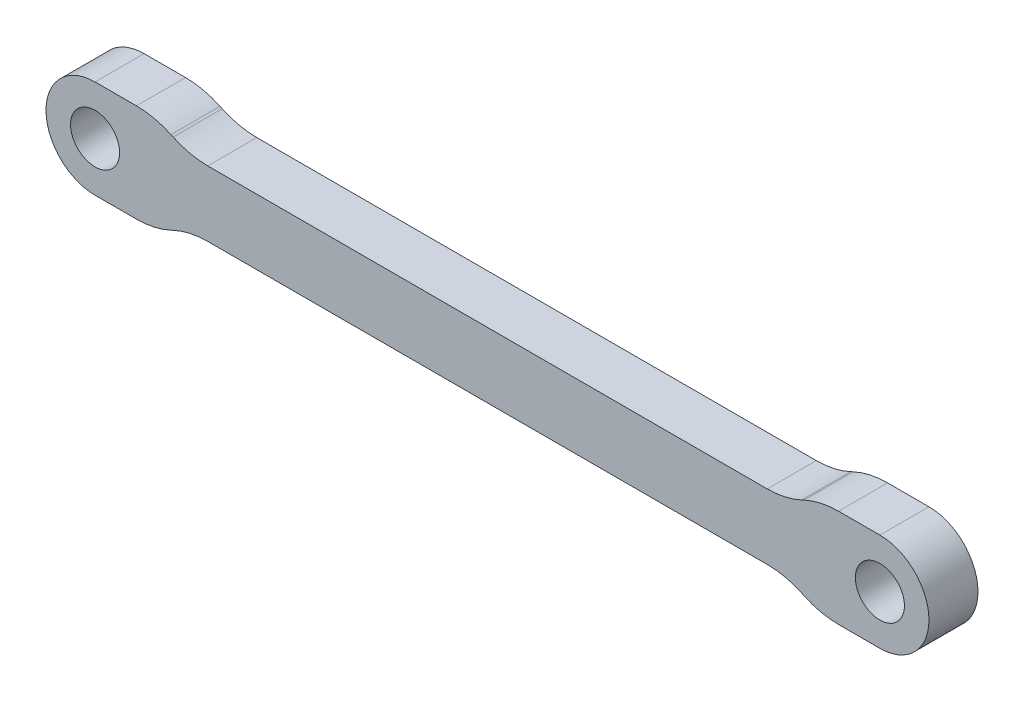
ISO-10303-21;
HEADER;
FILE_DESCRIPTION(('STEP AP214'),'2;1');
FILE_NAME('part.step','',(''),(''),'','','');
FILE_SCHEMA(('AUTOMOTIVE_DESIGN { 1 0 10303 214 1 1 1 1 }'));
ENDSEC;
DATA;
#1=APPLICATION_CONTEXT('core data for automotive mechanical design processes');
#2=APPLICATION_PROTOCOL_DEFINITION('international standard','automotive_design',2000,#1);
#3=PRODUCT_CONTEXT('',#1,'mechanical');
#4=PRODUCT('Part','Part','',(#3));
#5=PRODUCT_RELATED_PRODUCT_CATEGORY('part','',(#4));
#6=PRODUCT_DEFINITION_FORMATION('','',#4);
#7=PRODUCT_DEFINITION_CONTEXT('part definition',#1,'design');
#8=PRODUCT_DEFINITION('design','',#6,#7);
#9=PRODUCT_DEFINITION_SHAPE('','',#8);
#10=(LENGTH_UNIT() NAMED_UNIT(*) SI_UNIT(.MILLI.,.METRE.));
#11=(NAMED_UNIT(*) PLANE_ANGLE_UNIT() SI_UNIT($,.RADIAN.));
#12=(NAMED_UNIT(*) SI_UNIT($,.STERADIAN.) SOLID_ANGLE_UNIT());
#13=UNCERTAINTY_MEASURE_WITH_UNIT(LENGTH_MEASURE(1.E-05),#10,'distance_accuracy_value','');
#14=(GEOMETRIC_REPRESENTATION_CONTEXT(3) GLOBAL_UNCERTAINTY_ASSIGNED_CONTEXT((#13)) GLOBAL_UNIT_ASSIGNED_CONTEXT((#10,
#11,#12)) REPRESENTATION_CONTEXT('',''));
#15=CARTESIAN_POINT('',(0.,0.,0.));
#16=DIRECTION('',(0.,0.,1.));
#17=DIRECTION('',(1.,0.,0.));
#18=AXIS2_PLACEMENT_3D('',#15,#16,#17);
#19=CARTESIAN_POINT('',(0.,-6.,6.));
#20=DIRECTION('',(0.,1.,0.));
#21=DIRECTION('',(0.,0.,1.));
#22=AXIS2_PLACEMENT_3D('',#19,#20,#21);
#23=PLANE('',#22);
#24=DIRECTION('',(1.,0.,0.));
#25=VECTOR('',#24,1.);
#26=CARTESIAN_POINT('',(0.,-6.,6.));
#27=LINE('',#26,#25);
#28=CARTESIAN_POINT('',(90.9394812289775,-6.,6.));
#29=VERTEX_POINT('',#28);
#30=CARTESIAN_POINT('',(96.,-6.,6.));
#31=VERTEX_POINT('',#30);
#32=EDGE_CURVE('E185',#29,#31,#27,.T.);
#33=ORIENTED_EDGE('',*,*,#32,.F.);
#34=DIRECTION('',(0.,0.,1.));
#35=VECTOR('',#34,1.);
#36=CARTESIAN_POINT('',(90.9394812289775,-6.,0.));
#37=LINE('',#36,#35);
#38=CARTESIAN_POINT('',(90.9394812289775,-6.,0.));
#39=VERTEX_POINT('',#38);
#40=EDGE_CURVE('E261',#29,#39,#37,.F.);
#41=ORIENTED_EDGE('',*,*,#40,.T.);
#42=DIRECTION('',(1.,0.,0.));
#43=VECTOR('',#42,1.);
#44=CARTESIAN_POINT('',(0.,-6.,0.));
#45=LINE('',#44,#43);
#46=CARTESIAN_POINT('',(96.,-6.,0.));
#47=VERTEX_POINT('',#46);
#48=EDGE_CURVE('E338',#39,#47,#45,.T.);
#49=ORIENTED_EDGE('',*,*,#48,.T.);
#50=DIRECTION('',(0.,0.,-1.));
#51=VECTOR('',#50,1.);
#52=CARTESIAN_POINT('',(96.,-6.,6.));
#53=LINE('',#52,#51);
#54=EDGE_CURVE('E202',#31,#47,#53,.T.);
#55=ORIENTED_EDGE('',*,*,#54,.F.);
#56=EDGE_LOOP('',(#33,#41,#49,#55));
#57=FACE_BOUND('',#56,.T.);
#58=ADVANCED_FACE('F36',(#57),#23,.F.);
#59=CARTESIAN_POINT('',(0.,6.,6.));
#60=DIRECTION('',(0.,-1.,0.));
#61=DIRECTION('',(0.,0.,-1.));
#62=AXIS2_PLACEMENT_3D('',#59,#60,#61);
#63=PLANE('',#62);
#64=DIRECTION('',(-1.,0.,0.));
#65=VECTOR('',#64,1.);
#66=CARTESIAN_POINT('',(0.,6.,6.));
#67=LINE('',#66,#65);
#68=CARTESIAN_POINT('',(5.06051877102256,6.,6.));
#69=VERTEX_POINT('',#68);
#70=CARTESIAN_POINT('',(0.,6.,6.));
#71=VERTEX_POINT('',#70);
#72=EDGE_CURVE('E192',#69,#71,#67,.T.);
#73=ORIENTED_EDGE('',*,*,#72,.F.);
#74=DIRECTION('',(0.,0.,1.));
#75=VECTOR('',#74,1.);
#76=CARTESIAN_POINT('',(5.06051877102256,6.,0.));
#77=LINE('',#76,#75);
#78=CARTESIAN_POINT('',(5.06051877102256,6.,0.));
#79=VERTEX_POINT('',#78);
#80=EDGE_CURVE('E280',#69,#79,#77,.F.);
#81=ORIENTED_EDGE('',*,*,#80,.T.);
#82=DIRECTION('',(-1.,0.,0.));
#83=VECTOR('',#82,1.);
#84=CARTESIAN_POINT('',(0.,6.,0.));
#85=LINE('',#84,#83);
#86=CARTESIAN_POINT('',(0.,6.,0.));
#87=VERTEX_POINT('',#86);
#88=EDGE_CURVE('E343',#79,#87,#85,.T.);
#89=ORIENTED_EDGE('',*,*,#88,.T.);
#90=DIRECTION('',(0.,0.,-1.));
#91=VECTOR('',#90,1.);
#92=CARTESIAN_POINT('',(0.,6.,6.));
#93=LINE('',#92,#91);
#94=EDGE_CURVE('E336',#71,#87,#93,.T.);
#95=ORIENTED_EDGE('',*,*,#94,.F.);
#96=EDGE_LOOP('',(#73,#81,#89,#95));
#97=FACE_BOUND('',#96,.T.);
#98=ADVANCED_FACE('F400',(#97),#63,.F.);
#99=CARTESIAN_POINT('',(0.,0.,6.));
#100=DIRECTION('',(0.,0.,1.));
#101=DIRECTION('',(1.,0.,0.));
#102=AXIS2_PLACEMENT_3D('',#99,#100,#101);
#103=PLANE('',#102);
#104=CARTESIAN_POINT('',(0.,-6.,6.));
#105=VERTEX_POINT('',#104);
#106=CARTESIAN_POINT('',(5.06051877102256,-6.,6.));
#107=VERTEX_POINT('',#106);
#108=EDGE_CURVE('E174',#105,#107,#27,.T.);
#109=ORIENTED_EDGE('',*,*,#108,.T.);
#110=CARTESIAN_POINT('',(5.06051877102256,4.,6.));
#111=DIRECTION('',(0.,0.,1.));
#112=DIRECTION('',(1.,0.,0.));
#113=AXIS2_PLACEMENT_3D('',#110,#111,#112);
#114=CIRCLE('',#113,10.);
#115=CARTESIAN_POINT('',(9.28670138842951,-5.06307787036652,6.));
#116=VERTEX_POINT('',#115);
#117=EDGE_CURVE('E248',#107,#116,#114,.T.);
#118=ORIENTED_EDGE('',*,*,#117,.T.);
#119=DIRECTION('',(-0.906307787036652,-0.422618261740695,0.));
#120=VECTOR('',#119,1.);
#121=CARTESIAN_POINT('',(3.59793373438054,-7.71579379291397,6.));
#122=LINE('',#121,#120);
#123=CARTESIAN_POINT('',(9.55724324749352,-4.93692212963348,6.));
#124=VERTEX_POINT('',#123);
#125=EDGE_CURVE('E205',#116,#124,#122,.F.);
#126=ORIENTED_EDGE('',*,*,#125,.T.);
#127=CARTESIAN_POINT('',(13.7834258649005,-14.,6.));
#128=DIRECTION('',(0.,0.,1.));
#129=DIRECTION('',(1.,0.,0.));
#130=AXIS2_PLACEMENT_3D('',#127,#128,#129);
#131=CIRCLE('',#130,10.);
#132=CARTESIAN_POINT('',(13.7834258649005,-4.,6.));
#133=VERTEX_POINT('',#132);
#134=EDGE_CURVE('E285',#124,#133,#131,.F.);
#135=ORIENTED_EDGE('',*,*,#134,.T.);
#136=DIRECTION('',(-1.,0.,0.));
#137=VECTOR('',#136,1.);
#138=CARTESIAN_POINT('',(18.,-4.,6.));
#139=LINE('',#138,#137);
#140=CARTESIAN_POINT('',(82.2165741350996,-4.,6.));
#141=VERTEX_POINT('',#140);
#142=EDGE_CURVE('E312',#141,#133,#139,.T.);
#143=ORIENTED_EDGE('',*,*,#142,.F.);
#144=CARTESIAN_POINT('',(82.2165741350996,-14.,6.));
#145=DIRECTION('',(0.,0.,1.));
#146=DIRECTION('',(1.,0.,0.));
#147=AXIS2_PLACEMENT_3D('',#144,#145,#146);
#148=CIRCLE('',#147,10.);
#149=CARTESIAN_POINT('',(86.4427567525065,-4.93692212963347,6.));
#150=VERTEX_POINT('',#149);
#151=EDGE_CURVE('E287',#141,#150,#148,.F.);
#152=ORIENTED_EDGE('',*,*,#151,.T.);
#153=DIRECTION('',(-0.906307787036653,0.422618261740693,0.));
#154=VECTOR('',#153,1.);
#155=CARTESIAN_POINT('',(13.5482610006651,29.0543394767966,6.));
#156=LINE('',#155,#154);
#157=CARTESIAN_POINT('',(86.7132986115706,-5.06307787036654,6.));
#158=VERTEX_POINT('',#157);
#159=EDGE_CURVE('E214',#150,#158,#156,.F.);
#160=ORIENTED_EDGE('',*,*,#159,.T.);
#161=CARTESIAN_POINT('',(90.9394812289775,4.,6.));
#162=DIRECTION('',(0.,0.,1.));
#163=DIRECTION('',(1.,0.,0.));
#164=AXIS2_PLACEMENT_3D('',#161,#162,#163);
#165=CIRCLE('',#164,10.);
#166=EDGE_CURVE('E246',#158,#29,#165,.T.);
#167=ORIENTED_EDGE('',*,*,#166,.T.);
#168=ORIENTED_EDGE('',*,*,#32,.T.);
#169=CARTESIAN_POINT('',(96.,0.,6.));
#170=DIRECTION('',(0.,0.,1.));
#171=DIRECTION('',(1.,0.,0.));
#172=AXIS2_PLACEMENT_3D('',#169,#170,#171);
#173=CIRCLE('',#172,6.);
#174=CARTESIAN_POINT('',(96.,6.,6.));
#175=VERTEX_POINT('',#174);
#176=EDGE_CURVE('E184',#31,#175,#173,.T.);
#177=ORIENTED_EDGE('',*,*,#176,.T.);
#178=CARTESIAN_POINT('',(90.9394812289774,6.,6.));
#179=VERTEX_POINT('',#178);
#180=EDGE_CURVE('E333',#175,#179,#67,.T.);
#181=ORIENTED_EDGE('',*,*,#180,.T.);
#182=CARTESIAN_POINT('',(90.9394812289774,-4.,6.));
#183=DIRECTION('',(0.,0.,1.));
#184=DIRECTION('',(1.,0.,0.));
#185=AXIS2_PLACEMENT_3D('',#182,#183,#184);
#186=CIRCLE('',#185,10.);
#187=CARTESIAN_POINT('',(86.7132986115705,5.06307787036651,6.));
#188=VERTEX_POINT('',#187);
#189=EDGE_CURVE('E244',#179,#188,#186,.T.);
#190=ORIENTED_EDGE('',*,*,#189,.T.);
#191=DIRECTION('',(0.906307787036652,0.422618261740696,0.));
#192=VECTOR('',#191,1.);
#193=CARTESIAN_POINT('',(13.5482610006653,-29.0543394767967,6.));
#194=LINE('',#193,#192);
#195=CARTESIAN_POINT('',(86.4427567525065,4.9369221296335,6.));
#196=VERTEX_POINT('',#195);
#197=EDGE_CURVE('E217',#188,#196,#194,.F.);
#198=ORIENTED_EDGE('',*,*,#197,.T.);
#199=CARTESIAN_POINT('',(82.2165741350995,14.,6.));
#200=DIRECTION('',(0.,0.,1.));
#201=DIRECTION('',(1.,0.,0.));
#202=AXIS2_PLACEMENT_3D('',#199,#200,#201);
#203=CIRCLE('',#202,10.);
#204=CARTESIAN_POINT('',(82.2165741350995,4.,6.));
#205=VERTEX_POINT('',#204);
#206=EDGE_CURVE('E293',#196,#205,#203,.F.);
#207=ORIENTED_EDGE('',*,*,#206,.T.);
#208=DIRECTION('',(1.,0.,0.));
#209=VECTOR('',#208,1.);
#210=CARTESIAN_POINT('',(78.,4.,6.));
#211=LINE('',#210,#209);
#212=CARTESIAN_POINT('',(13.7834258649005,4.,6.));
#213=VERTEX_POINT('',#212);
#214=EDGE_CURVE('E297',#213,#205,#211,.T.);
#215=ORIENTED_EDGE('',*,*,#214,.F.);
#216=CARTESIAN_POINT('',(13.7834258649005,14.,6.));
#217=DIRECTION('',(0.,0.,1.));
#218=DIRECTION('',(1.,0.,0.));
#219=AXIS2_PLACEMENT_3D('',#216,#217,#218);
#220=CIRCLE('',#219,10.);
#221=CARTESIAN_POINT('',(9.55724324749353,4.93692212963348,6.));
#222=VERTEX_POINT('',#221);
#223=EDGE_CURVE('E44',#213,#222,#220,.F.);
#224=ORIENTED_EDGE('',*,*,#223,.T.);
#225=DIRECTION('',(0.906307787036652,-0.422618261740695,0.));
#226=VECTOR('',#225,1.);
#227=CARTESIAN_POINT('',(3.59793373438054,7.71579379291397,6.));
#228=LINE('',#227,#226);
#229=CARTESIAN_POINT('',(9.28670138842951,5.06307787036652,6.));
#230=VERTEX_POINT('',#229);
#231=EDGE_CURVE('E201',#222,#230,#228,.F.);
#232=ORIENTED_EDGE('',*,*,#231,.T.);
#233=CARTESIAN_POINT('',(5.06051877102256,-4.,6.));
#234=DIRECTION('',(0.,0.,1.));
#235=DIRECTION('',(1.,0.,0.));
#236=AXIS2_PLACEMENT_3D('',#233,#234,#235);
#237=CIRCLE('',#236,10.);
#238=EDGE_CURVE('E242',#230,#69,#237,.T.);
#239=ORIENTED_EDGE('',*,*,#238,.T.);
#240=ORIENTED_EDGE('',*,*,#72,.T.);
#241=CARTESIAN_POINT('',(0.,0.,6.));
#242=DIRECTION('',(0.,0.,1.));
#243=DIRECTION('',(1.,0.,0.));
#244=AXIS2_PLACEMENT_3D('',#241,#242,#243);
#245=CIRCLE('',#244,6.);
#246=EDGE_CURVE('E188',#71,#105,#245,.T.);
#247=ORIENTED_EDGE('',*,*,#246,.T.);
#248=EDGE_LOOP('',(#109,#118,#126,#135,#143,#152,#160,#167,#168,#177,#181,#190,#198,#207,#215,
#224,#232,#239,#240,#247));
#249=FACE_BOUND('',#248,.T.);
#250=CARTESIAN_POINT('',(0.,0.,6.));
#251=DIRECTION('',(0.,0.,1.));
#252=DIRECTION('',(1.,0.,0.));
#253=AXIS2_PLACEMENT_3D('',#250,#251,#252);
#254=CIRCLE('',#253,3.);
#255=CARTESIAN_POINT('',(3.,0.,6.));
#256=VERTEX_POINT('',#255);
#257=EDGE_CURVE('E327',#256,#256,#254,.T.);
#258=ORIENTED_EDGE('',*,*,#257,.F.);
#259=EDGE_LOOP('',(#258));
#260=FACE_BOUND('',#259,.T.);
#261=CARTESIAN_POINT('',(96.,0.,6.));
#262=DIRECTION('',(0.,0.,1.));
#263=DIRECTION('',(1.,0.,0.));
#264=AXIS2_PLACEMENT_3D('',#261,#262,#263);
#265=CIRCLE('',#264,3.00000000000001);
#266=CARTESIAN_POINT('',(99.,0.,6.));
#267=VERTEX_POINT('',#266);
#268=EDGE_CURVE('E320',#267,#267,#265,.T.);
#269=ORIENTED_EDGE('',*,*,#268,.F.);
#270=EDGE_LOOP('',(#269));
#271=FACE_BOUND('',#270,.T.);
#272=ADVANCED_FACE('F189',(#249,#260,#271),#103,.T.);
#273=CARTESIAN_POINT('',(0.,0.,0.));
#274=DIRECTION('',(0.,0.,1.));
#275=DIRECTION('',(1.,0.,0.));
#276=AXIS2_PLACEMENT_3D('',#273,#274,#275);
#277=PLANE('',#276);
#278=DIRECTION('',(0.906307787036652,0.422618261740695,0.));
#279=VECTOR('',#278,1.);
#280=CARTESIAN_POINT('',(7.27746539745193,-6.,0.));
#281=LINE('',#280,#279);
#282=CARTESIAN_POINT('',(9.55724324749352,-4.93692212963348,0.));
#283=VERTEX_POINT('',#282);
#284=CARTESIAN_POINT('',(9.28670138842951,-5.06307787036652,0.));
#285=VERTEX_POINT('',#284);
#286=EDGE_CURVE('E222',#283,#285,#281,.F.);
#287=ORIENTED_EDGE('',*,*,#286,.T.);
#288=CARTESIAN_POINT('',(5.06051877102256,4.,0.));
#289=DIRECTION('',(0.,0.,1.));
#290=DIRECTION('',(1.,0.,0.));
#291=AXIS2_PLACEMENT_3D('',#288,#289,#290);
#292=CIRCLE('',#291,10.);
#293=CARTESIAN_POINT('',(5.06051877102256,-6.,0.));
#294=VERTEX_POINT('',#293);
#295=EDGE_CURVE('E255',#285,#294,#292,.F.);
#296=ORIENTED_EDGE('',*,*,#295,.T.);
#297=CARTESIAN_POINT('',(0.,-6.,0.));
#298=VERTEX_POINT('',#297);
#299=EDGE_CURVE('E339',#298,#294,#45,.T.);
#300=ORIENTED_EDGE('',*,*,#299,.F.);
#301=CARTESIAN_POINT('',(0.,0.,0.));
#302=DIRECTION('',(0.,0.,1.));
#303=DIRECTION('',(1.,0.,0.));
#304=AXIS2_PLACEMENT_3D('',#301,#302,#303);
#305=CIRCLE('',#304,6.);
#306=EDGE_CURVE('E200',#87,#298,#305,.T.);
#307=ORIENTED_EDGE('',*,*,#306,.F.);
#308=ORIENTED_EDGE('',*,*,#88,.F.);
#309=CARTESIAN_POINT('',(5.06051877102256,-4.,0.));
#310=DIRECTION('',(0.,0.,1.));
#311=DIRECTION('',(1.,0.,0.));
#312=AXIS2_PLACEMENT_3D('',#309,#310,#311);
#313=CIRCLE('',#312,10.);
#314=CARTESIAN_POINT('',(9.28670138842951,5.06307787036652,0.));
#315=VERTEX_POINT('',#314);
#316=EDGE_CURVE('E58',#79,#315,#313,.F.);
#317=ORIENTED_EDGE('',*,*,#316,.T.);
#318=DIRECTION('',(-0.906307787036652,0.422618261740695,0.));
#319=VECTOR('',#318,1.);
#320=CARTESIAN_POINT('',(7.27746539745193,6.,0.));
#321=LINE('',#320,#319);
#322=CARTESIAN_POINT('',(9.55724324749353,4.93692212963348,0.));
#323=VERTEX_POINT('',#322);
#324=EDGE_CURVE('E220',#315,#323,#321,.F.);
#325=ORIENTED_EDGE('',*,*,#324,.T.);
#326=CARTESIAN_POINT('',(13.7834258649005,14.,0.));
#327=DIRECTION('',(0.,0.,1.));
#328=DIRECTION('',(1.,0.,0.));
#329=AXIS2_PLACEMENT_3D('',#326,#327,#328);
#330=CIRCLE('',#329,10.);
#331=CARTESIAN_POINT('',(13.7834258649005,4.,0.));
#332=VERTEX_POINT('',#331);
#333=EDGE_CURVE('E11',#323,#332,#330,.T.);
#334=ORIENTED_EDGE('',*,*,#333,.T.);
#335=DIRECTION('',(1.,0.,0.));
#336=VECTOR('',#335,1.);
#337=CARTESIAN_POINT('',(78.,4.,0.));
#338=LINE('',#337,#336);
#339=CARTESIAN_POINT('',(82.2165741350995,4.,0.));
#340=VERTEX_POINT('',#339);
#341=EDGE_CURVE('E308',#332,#340,#338,.T.);
#342=ORIENTED_EDGE('',*,*,#341,.T.);
#343=CARTESIAN_POINT('',(82.2165741350995,14.,0.));
#344=DIRECTION('',(0.,0.,1.));
#345=DIRECTION('',(1.,0.,0.));
#346=AXIS2_PLACEMENT_3D('',#343,#344,#345);
#347=CIRCLE('',#346,10.);
#348=CARTESIAN_POINT('',(86.4427567525065,4.93692212963349,0.));
#349=VERTEX_POINT('',#348);
#350=EDGE_CURVE('E291',#340,#349,#347,.T.);
#351=ORIENTED_EDGE('',*,*,#350,.T.);
#352=DIRECTION('',(-0.906307787036652,-0.422618261740696,0.));
#353=VECTOR('',#352,1.);
#354=CARTESIAN_POINT('',(88.7225346025481,6.,0.));
#355=LINE('',#354,#353);
#356=CARTESIAN_POINT('',(86.7132986115705,5.06307787036651,0.));
#357=VERTEX_POINT('',#356);
#358=EDGE_CURVE('E228',#349,#357,#355,.F.);
#359=ORIENTED_EDGE('',*,*,#358,.T.);
#360=CARTESIAN_POINT('',(90.9394812289774,-4.,0.));
#361=DIRECTION('',(0.,0.,1.));
#362=DIRECTION('',(1.,0.,0.));
#363=AXIS2_PLACEMENT_3D('',#360,#361,#362);
#364=CIRCLE('',#363,10.);
#365=CARTESIAN_POINT('',(90.9394812289774,6.,0.));
#366=VERTEX_POINT('',#365);
#367=EDGE_CURVE('E251',#357,#366,#364,.F.);
#368=ORIENTED_EDGE('',*,*,#367,.T.);
#369=CARTESIAN_POINT('',(96.,6.,0.));
#370=VERTEX_POINT('',#369);
#371=EDGE_CURVE('E196',#370,#366,#85,.T.);
#372=ORIENTED_EDGE('',*,*,#371,.F.);
#373=CARTESIAN_POINT('',(96.,0.,0.));
#374=DIRECTION('',(0.,0.,1.));
#375=DIRECTION('',(1.,0.,0.));
#376=AXIS2_PLACEMENT_3D('',#373,#374,#375);
#377=CIRCLE('',#376,6.);
#378=EDGE_CURVE('E341',#47,#370,#377,.T.);
#379=ORIENTED_EDGE('',*,*,#378,.F.);
#380=ORIENTED_EDGE('',*,*,#48,.F.);
#381=CARTESIAN_POINT('',(90.9394812289775,4.,0.));
#382=DIRECTION('',(0.,0.,1.));
#383=DIRECTION('',(1.,0.,0.));
#384=AXIS2_PLACEMENT_3D('',#381,#382,#383);
#385=CIRCLE('',#384,10.);
#386=CARTESIAN_POINT('',(86.7132986115706,-5.06307787036653,0.));
#387=VERTEX_POINT('',#386);
#388=EDGE_CURVE('E253',#39,#387,#385,.F.);
#389=ORIENTED_EDGE('',*,*,#388,.T.);
#390=DIRECTION('',(0.906307787036653,-0.422618261740693,0.));
#391=VECTOR('',#390,1.);
#392=CARTESIAN_POINT('',(88.7225346025481,-6.,0.));
#393=LINE('',#392,#391);
#394=CARTESIAN_POINT('',(86.4427567525065,-4.93692212963347,0.));
#395=VERTEX_POINT('',#394);
#396=EDGE_CURVE('E225',#387,#395,#393,.F.);
#397=ORIENTED_EDGE('',*,*,#396,.T.);
#398=CARTESIAN_POINT('',(82.2165741350996,-14.,0.));
#399=DIRECTION('',(0.,0.,1.));
#400=DIRECTION('',(1.,0.,0.));
#401=AXIS2_PLACEMENT_3D('',#398,#399,#400);
#402=CIRCLE('',#401,10.);
#403=CARTESIAN_POINT('',(82.2165741350996,-4.,0.));
#404=VERTEX_POINT('',#403);
#405=EDGE_CURVE('E289',#395,#404,#402,.T.);
#406=ORIENTED_EDGE('',*,*,#405,.T.);
#407=DIRECTION('',(-1.,0.,0.));
#408=VECTOR('',#407,1.);
#409=CARTESIAN_POINT('',(18.,-4.,0.));
#410=LINE('',#409,#408);
#411=CARTESIAN_POINT('',(13.7834258649005,-4.,0.));
#412=VERTEX_POINT('',#411);
#413=EDGE_CURVE('E315',#404,#412,#410,.T.);
#414=ORIENTED_EDGE('',*,*,#413,.T.);
#415=CARTESIAN_POINT('',(13.7834258649005,-14.,0.));
#416=DIRECTION('',(0.,0.,1.));
#417=DIRECTION('',(1.,0.,0.));
#418=AXIS2_PLACEMENT_3D('',#415,#416,#417);
#419=CIRCLE('',#418,10.);
#420=EDGE_CURVE('E283',#412,#283,#419,.T.);
#421=ORIENTED_EDGE('',*,*,#420,.T.);
#422=EDGE_LOOP('',(#287,#296,#300,#307,#308,#317,#325,#334,#342,#351,#359,#368,#372,#379,#380,
#389,#397,#406,#414,#421));
#423=FACE_BOUND('',#422,.T.);
#424=CARTESIAN_POINT('',(0.,0.,0.));
#425=DIRECTION('',(0.,0.,1.));
#426=DIRECTION('',(1.,0.,0.));
#427=AXIS2_PLACEMENT_3D('',#424,#425,#426);
#428=CIRCLE('',#427,3.);
#429=CARTESIAN_POINT('',(3.,0.,0.));
#430=VERTEX_POINT('',#429);
#431=EDGE_CURVE('E323',#430,#430,#428,.T.);
#432=ORIENTED_EDGE('',*,*,#431,.T.);
#433=EDGE_LOOP('',(#432));
#434=FACE_BOUND('',#433,.T.);
#435=CARTESIAN_POINT('',(96.,0.,0.));
#436=DIRECTION('',(0.,0.,1.));
#437=DIRECTION('',(1.,0.,0.));
#438=AXIS2_PLACEMENT_3D('',#435,#436,#437);
#439=CIRCLE('',#438,3.00000000000001);
#440=CARTESIAN_POINT('',(99.,0.,0.));
#441=VERTEX_POINT('',#440);
#442=EDGE_CURVE('E324',#441,#441,#439,.T.);
#443=ORIENTED_EDGE('',*,*,#442,.T.);
#444=EDGE_LOOP('',(#443));
#445=FACE_BOUND('',#444,.T.);
#446=ADVANCED_FACE('F306',(#423,#434,#445),#277,.F.);
#447=CARTESIAN_POINT('',(0.,0.,6.));
#448=DIRECTION('',(0.,0.,-1.));
#449=DIRECTION('',(-1.,0.,0.));
#450=AXIS2_PLACEMENT_3D('',#447,#448,#449);
#451=CYLINDRICAL_SURFACE('',#450,6.);
#452=ORIENTED_EDGE('',*,*,#306,.T.);
#453=DIRECTION('',(0.,0.,-1.));
#454=VECTOR('',#453,1.);
#455=CARTESIAN_POINT('',(0.,-6.,6.));
#456=LINE('',#455,#454);
#457=EDGE_CURVE('E179',#105,#298,#456,.T.);
#458=ORIENTED_EDGE('',*,*,#457,.F.);
#459=ORIENTED_EDGE('',*,*,#246,.F.);
#460=ORIENTED_EDGE('',*,*,#94,.T.);
#461=EDGE_LOOP('',(#452,#458,#459,#460));
#462=FACE_BOUND('',#461,.T.);
#463=ADVANCED_FACE('F198',(#462),#451,.T.);
#464=ORIENTED_EDGE('',*,*,#299,.T.);
#465=DIRECTION('',(0.,0.,-1.));
#466=VECTOR('',#465,1.);
#467=CARTESIAN_POINT('',(5.06051877102256,-6.,6.));
#468=LINE('',#467,#466);
#469=EDGE_CURVE('E182',#294,#107,#468,.F.);
#470=ORIENTED_EDGE('',*,*,#469,.T.);
#471=ORIENTED_EDGE('',*,*,#108,.F.);
#472=ORIENTED_EDGE('',*,*,#457,.T.);
#473=EDGE_LOOP('',(#464,#470,#471,#472));
#474=FACE_BOUND('',#473,.T.);
#475=ADVANCED_FACE('F177',(#474),#23,.F.);
#476=CARTESIAN_POINT('',(96.,0.,6.));
#477=DIRECTION('',(0.,0.,-1.));
#478=DIRECTION('',(-1.,0.,0.));
#479=AXIS2_PLACEMENT_3D('',#476,#477,#478);
#480=CYLINDRICAL_SURFACE('',#479,6.);
#481=ORIENTED_EDGE('',*,*,#378,.T.);
#482=DIRECTION('',(0.,0.,-1.));
#483=VECTOR('',#482,1.);
#484=CARTESIAN_POINT('',(96.,6.,6.));
#485=LINE('',#484,#483);
#486=EDGE_CURVE('E208',#175,#370,#485,.T.);
#487=ORIENTED_EDGE('',*,*,#486,.F.);
#488=ORIENTED_EDGE('',*,*,#176,.F.);
#489=ORIENTED_EDGE('',*,*,#54,.T.);
#490=EDGE_LOOP('',(#481,#487,#488,#489));
#491=FACE_BOUND('',#490,.T.);
#492=ADVANCED_FACE('F365',(#491),#480,.T.);
#493=ORIENTED_EDGE('',*,*,#371,.T.);
#494=DIRECTION('',(0.,0.,-1.));
#495=VECTOR('',#494,1.);
#496=CARTESIAN_POINT('',(90.9394812289774,6.,6.));
#497=LINE('',#496,#495);
#498=EDGE_CURVE('E274',#366,#179,#497,.F.);
#499=ORIENTED_EDGE('',*,*,#498,.T.);
#500=ORIENTED_EDGE('',*,*,#180,.F.);
#501=ORIENTED_EDGE('',*,*,#486,.T.);
#502=EDGE_LOOP('',(#493,#499,#500,#501));
#503=FACE_BOUND('',#502,.T.);
#504=ADVANCED_FACE('F351',(#503),#63,.F.);
#505=CARTESIAN_POINT('',(0.,0.,6.));
#506=DIRECTION('',(0.,0.,-1.));
#507=DIRECTION('',(-1.,0.,0.));
#508=AXIS2_PLACEMENT_3D('',#505,#506,#507);
#509=CYLINDRICAL_SURFACE('',#508,3.);
#510=ORIENTED_EDGE('',*,*,#257,.T.);
#511=EDGE_LOOP('',(#510));
#512=FACE_BOUND('',#511,.T.);
#513=ORIENTED_EDGE('',*,*,#431,.F.);
#514=EDGE_LOOP('',(#513));
#515=FACE_BOUND('',#514,.T.);
#516=ADVANCED_FACE('F542',(#512,#515),#509,.F.);
#517=CARTESIAN_POINT('',(96.,0.,6.));
#518=DIRECTION('',(0.,0.,-1.));
#519=DIRECTION('',(-1.,0.,0.));
#520=AXIS2_PLACEMENT_3D('',#517,#518,#519);
#521=CYLINDRICAL_SURFACE('',#520,3.00000000000001);
#522=ORIENTED_EDGE('',*,*,#268,.T.);
#523=EDGE_LOOP('',(#522));
#524=FACE_BOUND('',#523,.T.);
#525=ORIENTED_EDGE('',*,*,#442,.F.);
#526=EDGE_LOOP('',(#525));
#527=FACE_BOUND('',#526,.T.);
#528=ADVANCED_FACE('F523',(#524,#527),#521,.F.);
#529=CARTESIAN_POINT('',(78.,4.,0.));
#530=DIRECTION('',(0.,-1.,0.));
#531=DIRECTION('',(0.,0.,-1.));
#532=AXIS2_PLACEMENT_3D('',#529,#530,#531);
#533=PLANE('',#532);
#534=ORIENTED_EDGE('',*,*,#214,.T.);
#535=DIRECTION('',(0.,0.,1.));
#536=VECTOR('',#535,1.);
#537=CARTESIAN_POINT('',(82.2165741350995,4.,0.));
#538=LINE('',#537,#536);
#539=EDGE_CURVE('E267',#205,#340,#538,.F.);
#540=ORIENTED_EDGE('',*,*,#539,.T.);
#541=ORIENTED_EDGE('',*,*,#341,.F.);
#542=DIRECTION('',(0.,0.,-1.));
#543=VECTOR('',#542,1.);
#544=CARTESIAN_POINT('',(13.7834258649005,4.,0.));
#545=LINE('',#544,#543);
#546=EDGE_CURVE('E264',#332,#213,#545,.F.);
#547=ORIENTED_EDGE('',*,*,#546,.T.);
#548=EDGE_LOOP('',(#534,#540,#541,#547));
#549=FACE_BOUND('',#548,.T.);
#550=ADVANCED_FACE('F310',(#549),#533,.F.);
#551=CARTESIAN_POINT('',(18.,-4.,0.));
#552=DIRECTION('',(0.,1.,0.));
#553=DIRECTION('',(0.,0.,1.));
#554=AXIS2_PLACEMENT_3D('',#551,#552,#553);
#555=PLANE('',#554);
#556=ORIENTED_EDGE('',*,*,#142,.T.);
#557=DIRECTION('',(0.,0.,1.));
#558=VECTOR('',#557,1.);
#559=CARTESIAN_POINT('',(13.7834258649005,-4.,0.));
#560=LINE('',#559,#558);
#561=EDGE_CURVE('E234',#133,#412,#560,.F.);
#562=ORIENTED_EDGE('',*,*,#561,.T.);
#563=ORIENTED_EDGE('',*,*,#413,.F.);
#564=DIRECTION('',(0.,0.,-1.));
#565=VECTOR('',#564,1.);
#566=CARTESIAN_POINT('',(82.2165741350996,-4.,0.));
#567=LINE('',#566,#565);
#568=EDGE_CURVE('E231',#404,#141,#567,.F.);
#569=ORIENTED_EDGE('',*,*,#568,.T.);
#570=EDGE_LOOP('',(#556,#562,#563,#569));
#571=FACE_BOUND('',#570,.T.);
#572=ADVANCED_FACE('F385',(#571),#555,.F.);
#573=CARTESIAN_POINT('',(88.7225346025481,6.,6.));
#574=DIRECTION('',(0.422618261740696,-0.906307787036652,0.));
#575=DIRECTION('',(0.,0.,1.));
#576=AXIS2_PLACEMENT_3D('',#573,#574,#575);
#577=PLANE('',#576);
#578=ORIENTED_EDGE('',*,*,#358,.F.);
#579=DIRECTION('',(0.,0.,-1.));
#580=VECTOR('',#579,1.);
#581=CARTESIAN_POINT('',(86.4427567525065,4.93692212963349,6.));
#582=LINE('',#581,#580);
#583=EDGE_CURVE('E272',#349,#196,#582,.F.);
#584=ORIENTED_EDGE('',*,*,#583,.T.);
#585=ORIENTED_EDGE('',*,*,#197,.F.);
#586=DIRECTION('',(0.,0.,1.));
#587=VECTOR('',#586,1.);
#588=CARTESIAN_POINT('',(86.7132986115705,5.06307787036651,0.));
#589=LINE('',#588,#587);
#590=EDGE_CURVE('E270',#188,#357,#589,.F.);
#591=ORIENTED_EDGE('',*,*,#590,.T.);
#592=EDGE_LOOP('',(#578,#584,#585,#591));
#593=FACE_BOUND('',#592,.T.);
#594=ADVANCED_FACE('F425',(#593),#577,.F.);
#595=CARTESIAN_POINT('',(88.7225346025481,-6.,6.));
#596=DIRECTION('',(0.422618261740693,0.906307787036653,0.));
#597=DIRECTION('',(0.,0.,-1.));
#598=AXIS2_PLACEMENT_3D('',#595,#596,#597);
#599=PLANE('',#598);
#600=ORIENTED_EDGE('',*,*,#159,.F.);
#601=DIRECTION('',(0.,0.,1.));
#602=VECTOR('',#601,1.);
#603=CARTESIAN_POINT('',(86.4427567525065,-4.93692212963347,6.));
#604=LINE('',#603,#602);
#605=EDGE_CURVE('E259',#150,#395,#604,.F.);
#606=ORIENTED_EDGE('',*,*,#605,.T.);
#607=ORIENTED_EDGE('',*,*,#396,.F.);
#608=DIRECTION('',(0.,0.,-1.));
#609=VECTOR('',#608,1.);
#610=CARTESIAN_POINT('',(86.7132986115706,-5.06307787036653,6.));
#611=LINE('',#610,#609);
#612=EDGE_CURVE('E257',#387,#158,#611,.F.);
#613=ORIENTED_EDGE('',*,*,#612,.T.);
#614=EDGE_LOOP('',(#600,#606,#607,#613));
#615=FACE_BOUND('',#614,.T.);
#616=ADVANCED_FACE('F374',(#615),#599,.F.);
#617=CARTESIAN_POINT('',(7.27746539745193,-6.,6.));
#618=DIRECTION('',(-0.422618261740695,0.906307787036652,0.));
#619=DIRECTION('',(0.,0.,1.));
#620=AXIS2_PLACEMENT_3D('',#617,#618,#619);
#621=PLANE('',#620);
#622=ORIENTED_EDGE('',*,*,#286,.F.);
#623=DIRECTION('',(0.,0.,-1.));
#624=VECTOR('',#623,1.);
#625=CARTESIAN_POINT('',(9.55724324749352,-4.93692212963348,6.));
#626=LINE('',#625,#624);
#627=EDGE_CURVE('E239',#283,#124,#626,.F.);
#628=ORIENTED_EDGE('',*,*,#627,.T.);
#629=ORIENTED_EDGE('',*,*,#125,.F.);
#630=DIRECTION('',(0.,0.,1.));
#631=VECTOR('',#630,1.);
#632=CARTESIAN_POINT('',(9.28670138842951,-5.06307787036652,0.));
#633=LINE('',#632,#631);
#634=EDGE_CURVE('E237',#116,#285,#633,.F.);
#635=ORIENTED_EDGE('',*,*,#634,.T.);
#636=EDGE_LOOP('',(#622,#628,#629,#635));
#637=FACE_BOUND('',#636,.T.);
#638=ADVANCED_FACE('F394',(#637),#621,.F.);
#639=CARTESIAN_POINT('',(7.27746539745193,6.,6.));
#640=DIRECTION('',(-0.422618261740695,-0.906307787036652,0.));
#641=DIRECTION('',(0.,0.,-1.));
#642=AXIS2_PLACEMENT_3D('',#639,#640,#641);
#643=PLANE('',#642);
#644=ORIENTED_EDGE('',*,*,#231,.F.);
#645=DIRECTION('',(0.,0.,1.));
#646=VECTOR('',#645,1.);
#647=CARTESIAN_POINT('',(9.55724324749353,4.93692212963348,6.));
#648=LINE('',#647,#646);
#649=EDGE_CURVE('E51',#222,#323,#648,.F.);
#650=ORIENTED_EDGE('',*,*,#649,.T.);
#651=ORIENTED_EDGE('',*,*,#324,.F.);
#652=DIRECTION('',(0.,0.,-1.));
#653=VECTOR('',#652,1.);
#654=CARTESIAN_POINT('',(9.28670138842951,5.06307787036652,6.));
#655=LINE('',#654,#653);
#656=EDGE_CURVE('E277',#315,#230,#655,.F.);
#657=ORIENTED_EDGE('',*,*,#656,.T.);
#658=EDGE_LOOP('',(#644,#650,#651,#657));
#659=FACE_BOUND('',#658,.T.);
#660=ADVANCED_FACE('F300',(#659),#643,.F.);
#661=CARTESIAN_POINT('',(13.7834258649005,-14.,0.));
#662=DIRECTION('',(0.,0.,1.));
#663=DIRECTION('',(1.,0.,0.));
#664=AXIS2_PLACEMENT_3D('',#661,#662,#663);
#665=CYLINDRICAL_SURFACE('',#664,10.);
#666=ORIENTED_EDGE('',*,*,#134,.F.);
#667=ORIENTED_EDGE('',*,*,#627,.F.);
#668=ORIENTED_EDGE('',*,*,#420,.F.);
#669=ORIENTED_EDGE('',*,*,#561,.F.);
#670=EDGE_LOOP('',(#666,#667,#668,#669));
#671=FACE_BOUND('',#670,.T.);
#672=ADVANCED_FACE('F389',(#671),#665,.F.);
#673=CARTESIAN_POINT('',(5.06051877102256,4.,6.));
#674=DIRECTION('',(0.,0.,1.));
#675=DIRECTION('',(1.,0.,0.));
#676=AXIS2_PLACEMENT_3D('',#673,#674,#675);
#677=CYLINDRICAL_SURFACE('',#676,10.);
#678=ORIENTED_EDGE('',*,*,#295,.F.);
#679=ORIENTED_EDGE('',*,*,#634,.F.);
#680=ORIENTED_EDGE('',*,*,#117,.F.);
#681=ORIENTED_EDGE('',*,*,#469,.F.);
#682=EDGE_LOOP('',(#678,#679,#680,#681));
#683=FACE_BOUND('',#682,.T.);
#684=ADVANCED_FACE('F398',(#683),#677,.T.);
#685=CARTESIAN_POINT('',(82.2165741350996,-14.,0.));
#686=DIRECTION('',(0.,0.,-1.));
#687=DIRECTION('',(-1.,0.,0.));
#688=AXIS2_PLACEMENT_3D('',#685,#686,#687);
#689=CYLINDRICAL_SURFACE('',#688,10.);
#690=ORIENTED_EDGE('',*,*,#405,.F.);
#691=ORIENTED_EDGE('',*,*,#605,.F.);
#692=ORIENTED_EDGE('',*,*,#151,.F.);
#693=ORIENTED_EDGE('',*,*,#568,.F.);
#694=EDGE_LOOP('',(#690,#691,#692,#693));
#695=FACE_BOUND('',#694,.T.);
#696=ADVANCED_FACE('F380',(#695),#689,.F.);
#697=CARTESIAN_POINT('',(90.9394812289775,4.,6.));
#698=DIRECTION('',(0.,0.,-1.));
#699=DIRECTION('',(-1.,0.,0.));
#700=AXIS2_PLACEMENT_3D('',#697,#698,#699);
#701=CYLINDRICAL_SURFACE('',#700,10.);
#702=ORIENTED_EDGE('',*,*,#166,.F.);
#703=ORIENTED_EDGE('',*,*,#612,.F.);
#704=ORIENTED_EDGE('',*,*,#388,.F.);
#705=ORIENTED_EDGE('',*,*,#40,.F.);
#706=EDGE_LOOP('',(#702,#703,#704,#705));
#707=FACE_BOUND('',#706,.T.);
#708=ADVANCED_FACE('F377',(#707),#701,.T.);
#709=CARTESIAN_POINT('',(82.2165741350995,14.,0.));
#710=DIRECTION('',(0.,0.,1.));
#711=DIRECTION('',(1.,0.,0.));
#712=AXIS2_PLACEMENT_3D('',#709,#710,#711);
#713=CYLINDRICAL_SURFACE('',#712,10.);
#714=ORIENTED_EDGE('',*,*,#206,.F.);
#715=ORIENTED_EDGE('',*,*,#583,.F.);
#716=ORIENTED_EDGE('',*,*,#350,.F.);
#717=ORIENTED_EDGE('',*,*,#539,.F.);
#718=EDGE_LOOP('',(#714,#715,#716,#717));
#719=FACE_BOUND('',#718,.T.);
#720=ADVANCED_FACE('F443',(#719),#713,.F.);
#721=CARTESIAN_POINT('',(90.9394812289774,-4.,6.));
#722=DIRECTION('',(0.,0.,1.));
#723=DIRECTION('',(1.,0.,0.));
#724=AXIS2_PLACEMENT_3D('',#721,#722,#723);
#725=CYLINDRICAL_SURFACE('',#724,10.);
#726=ORIENTED_EDGE('',*,*,#367,.F.);
#727=ORIENTED_EDGE('',*,*,#590,.F.);
#728=ORIENTED_EDGE('',*,*,#189,.F.);
#729=ORIENTED_EDGE('',*,*,#498,.F.);
#730=EDGE_LOOP('',(#726,#727,#728,#729));
#731=FACE_BOUND('',#730,.T.);
#732=ADVANCED_FACE('F361',(#731),#725,.T.);
#733=CARTESIAN_POINT('',(13.7834258649005,14.,0.));
#734=DIRECTION('',(0.,0.,-1.));
#735=DIRECTION('',(-1.,0.,0.));
#736=AXIS2_PLACEMENT_3D('',#733,#734,#735);
#737=CYLINDRICAL_SURFACE('',#736,10.);
#738=ORIENTED_EDGE('',*,*,#333,.F.);
#739=ORIENTED_EDGE('',*,*,#649,.F.);
#740=ORIENTED_EDGE('',*,*,#223,.F.);
#741=ORIENTED_EDGE('',*,*,#546,.F.);
#742=EDGE_LOOP('',(#738,#739,#740,#741));
#743=FACE_BOUND('',#742,.T.);
#744=ADVANCED_FACE('F303',(#743),#737,.F.);
#745=CARTESIAN_POINT('',(5.06051877102256,-4.,6.));
#746=DIRECTION('',(0.,0.,-1.));
#747=DIRECTION('',(-1.,0.,0.));
#748=AXIS2_PLACEMENT_3D('',#745,#746,#747);
#749=CYLINDRICAL_SURFACE('',#748,10.);
#750=ORIENTED_EDGE('',*,*,#238,.F.);
#751=ORIENTED_EDGE('',*,*,#656,.F.);
#752=ORIENTED_EDGE('',*,*,#316,.F.);
#753=ORIENTED_EDGE('',*,*,#80,.F.);
#754=EDGE_LOOP('',(#750,#751,#752,#753));
#755=FACE_BOUND('',#754,.T.);
#756=ADVANCED_FACE('F38',(#755),#749,.T.);
#757=CLOSED_SHELL('',(#58,#98,#272,#446,#463,#475,#492,#504,#516,#528,#550,#572,#594,#616,#638,
#660,#672,#684,#696,#708,#720,#732,#744,#756));
#758=MANIFOLD_SOLID_BREP('B2',#757);
#759=ADVANCED_BREP_SHAPE_REPRESENTATION('',(#18,#758),#14);
#760=SHAPE_DEFINITION_REPRESENTATION(#9,#759);
ENDSEC;
END-ISO-10303-21;
